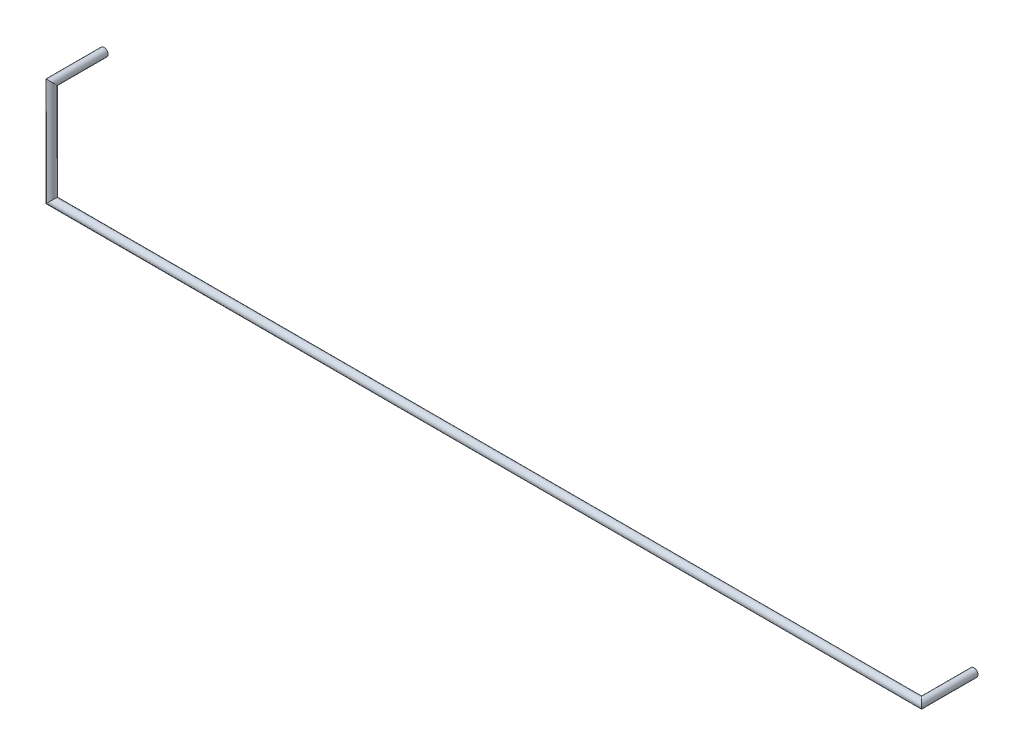
ISO-10303-21;
HEADER;
FILE_DESCRIPTION(('STEP AP214'),'2;1');
FILE_NAME('part.step','',(''),(''),'','','');
FILE_SCHEMA(('AUTOMOTIVE_DESIGN { 1 0 10303 214 1 1 1 1 }'));
ENDSEC;
DATA;
#1=APPLICATION_CONTEXT('core data for automotive mechanical design processes');
#2=APPLICATION_PROTOCOL_DEFINITION('international standard','automotive_design',2000,#1);
#3=PRODUCT_CONTEXT('',#1,'mechanical');
#4=PRODUCT('Part','Part','',(#3));
#5=PRODUCT_RELATED_PRODUCT_CATEGORY('part','',(#4));
#6=PRODUCT_DEFINITION_FORMATION('','',#4);
#7=PRODUCT_DEFINITION_CONTEXT('part definition',#1,'design');
#8=PRODUCT_DEFINITION('design','',#6,#7);
#9=PRODUCT_DEFINITION_SHAPE('','',#8);
#10=(LENGTH_UNIT() NAMED_UNIT(*) SI_UNIT(.MILLI.,.METRE.));
#11=(NAMED_UNIT(*) PLANE_ANGLE_UNIT() SI_UNIT($,.RADIAN.));
#12=(NAMED_UNIT(*) SI_UNIT($,.STERADIAN.) SOLID_ANGLE_UNIT());
#13=UNCERTAINTY_MEASURE_WITH_UNIT(LENGTH_MEASURE(1.E-05),#10,'distance_accuracy_value','');
#14=(GEOMETRIC_REPRESENTATION_CONTEXT(3) GLOBAL_UNCERTAINTY_ASSIGNED_CONTEXT((#13)) GLOBAL_UNIT_ASSIGNED_CONTEXT((#10,
#11,#12)) REPRESENTATION_CONTEXT('',''));
#15=CARTESIAN_POINT('',(0.,0.,0.));
#16=DIRECTION('',(0.,0.,1.));
#17=DIRECTION('',(1.,0.,0.));
#18=AXIS2_PLACEMENT_3D('',#15,#16,#17);
#19=CARTESIAN_POINT('',(43.18,-5.08,0.));
#20=DIRECTION('',(0.,0.,1.));
#21=DIRECTION('',(1.,0.,0.));
#22=AXIS2_PLACEMENT_3D('',#19,#20,#21);
#23=PLANE('',#22);
#24=CARTESIAN_POINT('',(43.18,-5.08,0.));
#25=DIRECTION('',(0.,0.,1.));
#26=DIRECTION('',(1.,0.,0.));
#27=AXIS2_PLACEMENT_3D('',#24,#25,#26);
#28=CIRCLE('',#27,0.199999999999999);
#29=CARTESIAN_POINT('',(43.38,-5.08,0.));
#30=VERTEX_POINT('',#29);
#31=EDGE_CURVE('E52',#30,#30,#28,.T.);
#32=ORIENTED_EDGE('',*,*,#31,.F.);
#33=EDGE_LOOP('',(#32));
#34=FACE_BOUND('',#33,.T.);
#35=ADVANCED_FACE('F49',(#34),#23,.F.);
#36=CARTESIAN_POINT('',(0.,0.,0.));
#37=DIRECTION('',(0.,0.,-1.));
#38=DIRECTION('',(0.,1.,0.));
#39=AXIS2_PLACEMENT_3D('',#36,#37,#38);
#40=PLANE('',#39);
#41=CARTESIAN_POINT('',(0.,0.,0.));
#42=DIRECTION('',(0.,0.,-1.));
#43=DIRECTION('',(0.,1.,0.));
#44=AXIS2_PLACEMENT_3D('',#41,#42,#43);
#45=CIRCLE('',#44,0.199999999999999);
#46=CARTESIAN_POINT('',(0.,0.199999999999999,0.));
#47=VERTEX_POINT('',#46);
#48=EDGE_CURVE('E57',#47,#47,#45,.T.);
#49=ORIENTED_EDGE('',*,*,#48,.T.);
#50=EDGE_LOOP('',(#49));
#51=FACE_BOUND('',#50,.T.);
#52=ADVANCED_FACE('F80',(#51),#40,.T.);
#53=CARTESIAN_POINT('',(43.18,-5.08,2.92));
#54=DIRECTION('',(0.,0.,-1.));
#55=DIRECTION('',(-1.,0.,0.));
#56=AXIS2_PLACEMENT_3D('',#53,#54,#55);
#57=CYLINDRICAL_SURFACE('',#56,0.199999999999999);
#58=CARTESIAN_POINT('',(43.18,-5.08,2.6));
#59=DIRECTION('',(0.707106781186548,0.,-0.707106781186548));
#60=DIRECTION('',(0.707106781186548,0.,0.707106781186548));
#61=AXIS2_PLACEMENT_3D('',#58,#59,#60);
#62=ELLIPSE('',#61,0.282842712474617,0.199999999999999);
#63=CARTESIAN_POINT('',(43.38,-5.08,2.8));
#64=VERTEX_POINT('',#63);
#65=EDGE_CURVE('E68',#64,#64,#62,.T.);
#66=ORIENTED_EDGE('',*,*,#65,.T.);
#67=EDGE_LOOP('',(#66));
#68=FACE_BOUND('',#67,.T.);
#69=ORIENTED_EDGE('',*,*,#31,.T.);
#70=EDGE_LOOP('',(#69));
#71=FACE_BOUND('',#70,.T.);
#72=ADVANCED_FACE('F77',(#68,#71),#57,.T.);
#73=CARTESIAN_POINT('',(-0.539999999999997,-5.08,2.6));
#74=DIRECTION('',(1.,0.,0.));
#75=DIRECTION('',(0.,0.,-1.));
#76=AXIS2_PLACEMENT_3D('',#73,#74,#75);
#77=CYLINDRICAL_SURFACE('',#76,0.199999999999999);
#78=CARTESIAN_POINT('',(0.,-5.08,2.6));
#79=DIRECTION('',(0.707106781186548,-0.707106781186548,0.));
#80=DIRECTION('',(-0.707106781186548,-0.707106781186548,0.));
#81=AXIS2_PLACEMENT_3D('',#78,#79,#80);
#82=ELLIPSE('',#81,0.282842712474617,0.199999999999999);
#83=CARTESIAN_POINT('',(-0.199999999999999,-5.28,2.6));
#84=VERTEX_POINT('',#83);
#85=EDGE_CURVE('E63',#84,#84,#82,.T.);
#86=ORIENTED_EDGE('',*,*,#85,.T.);
#87=EDGE_LOOP('',(#86));
#88=FACE_BOUND('',#87,.T.);
#89=ORIENTED_EDGE('',*,*,#65,.F.);
#90=EDGE_LOOP('',(#89));
#91=FACE_BOUND('',#90,.T.);
#92=ADVANCED_FACE('F93',(#88,#91),#77,.T.);
#93=CARTESIAN_POINT('',(0.,0.319999999999996,2.6));
#94=DIRECTION('',(0.,-1.,0.));
#95=DIRECTION('',(1.,0.,0.));
#96=AXIS2_PLACEMENT_3D('',#93,#94,#95);
#97=CYLINDRICAL_SURFACE('',#96,0.199999999999999);
#98=CARTESIAN_POINT('',(0.,0.,2.6));
#99=DIRECTION('',(0.,-0.707106781186548,0.707106781186548));
#100=DIRECTION('',(0.,0.707106781186548,0.707106781186548));
#101=AXIS2_PLACEMENT_3D('',#98,#99,#100);
#102=ELLIPSE('',#101,0.282842712474617,0.199999999999999);
#103=CARTESIAN_POINT('',(0.,0.199999999999999,2.8));
#104=VERTEX_POINT('',#103);
#105=EDGE_CURVE('E11',#104,#104,#102,.T.);
#106=ORIENTED_EDGE('',*,*,#105,.T.);
#107=EDGE_LOOP('',(#106));
#108=FACE_BOUND('',#107,.T.);
#109=ORIENTED_EDGE('',*,*,#85,.F.);
#110=EDGE_LOOP('',(#109));
#111=FACE_BOUND('',#110,.T.);
#112=ADVANCED_FACE('F87',(#108,#111),#97,.T.);
#113=CARTESIAN_POINT('',(0.,0.,0.));
#114=DIRECTION('',(0.,0.,1.));
#115=DIRECTION('',(1.,0.,0.));
#116=AXIS2_PLACEMENT_3D('',#113,#114,#115);
#117=CYLINDRICAL_SURFACE('',#116,0.199999999999999);
#118=ORIENTED_EDGE('',*,*,#48,.F.);
#119=EDGE_LOOP('',(#118));
#120=FACE_BOUND('',#119,.T.);
#121=ORIENTED_EDGE('',*,*,#105,.F.);
#122=EDGE_LOOP('',(#121));
#123=FACE_BOUND('',#122,.T.);
#124=ADVANCED_FACE('F85',(#120,#123),#117,.T.);
#125=CLOSED_SHELL('',(#35,#52,#72,#92,#112,#124));
#126=MANIFOLD_SOLID_BREP('B2',#125);
#127=ADVANCED_BREP_SHAPE_REPRESENTATION('',(#18,#126),#14);
#128=SHAPE_DEFINITION_REPRESENTATION(#9,#127);
ENDSEC;
END-ISO-10303-21;
